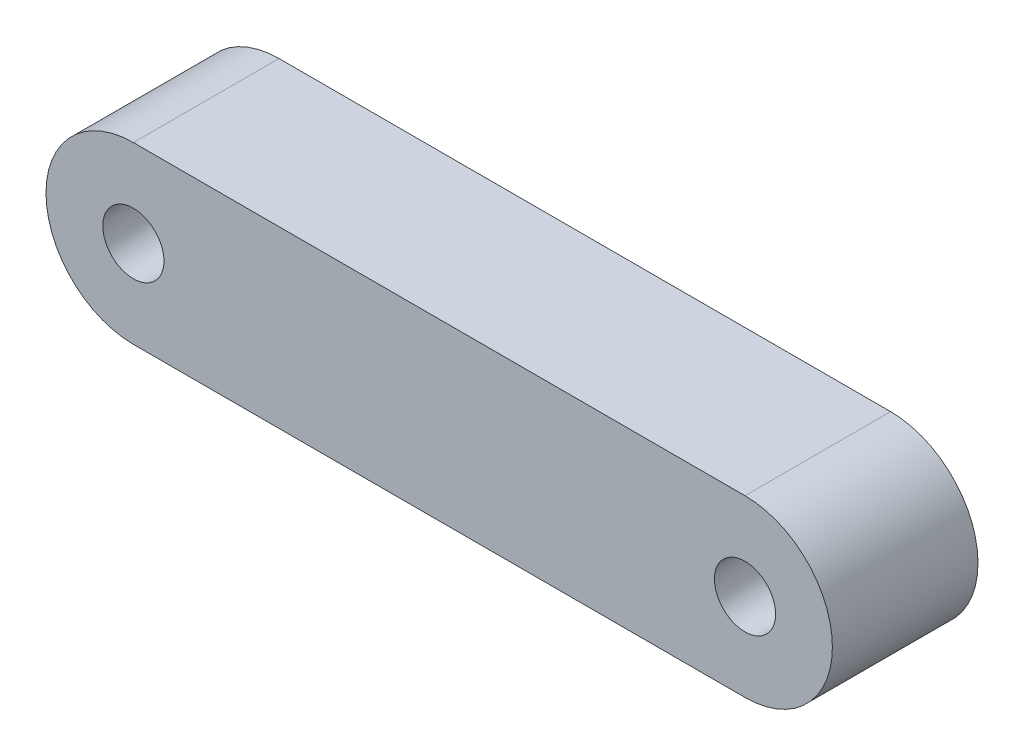
ISO-10303-21;
HEADER;
FILE_DESCRIPTION(('STEP AP214'),'2;1');
FILE_NAME('part.step','',(''),(''),'','','');
FILE_SCHEMA(('AUTOMOTIVE_DESIGN { 1 0 10303 214 1 1 1 1 }'));
ENDSEC;
DATA;
#1=APPLICATION_CONTEXT('core data for automotive mechanical design processes');
#2=APPLICATION_PROTOCOL_DEFINITION('international standard','automotive_design',2000,#1);
#3=PRODUCT_CONTEXT('',#1,'mechanical');
#4=PRODUCT('Part','Part','',(#3));
#5=PRODUCT_RELATED_PRODUCT_CATEGORY('part','',(#4));
#6=PRODUCT_DEFINITION_FORMATION('','',#4);
#7=PRODUCT_DEFINITION_CONTEXT('part definition',#1,'design');
#8=PRODUCT_DEFINITION('design','',#6,#7);
#9=PRODUCT_DEFINITION_SHAPE('','',#8);
#10=(LENGTH_UNIT() NAMED_UNIT(*) SI_UNIT(.MILLI.,.METRE.));
#11=(NAMED_UNIT(*) PLANE_ANGLE_UNIT() SI_UNIT($,.RADIAN.));
#12=(NAMED_UNIT(*) SI_UNIT($,.STERADIAN.) SOLID_ANGLE_UNIT());
#13=UNCERTAINTY_MEASURE_WITH_UNIT(LENGTH_MEASURE(1.E-05),#10,'distance_accuracy_value','');
#14=(GEOMETRIC_REPRESENTATION_CONTEXT(3) GLOBAL_UNCERTAINTY_ASSIGNED_CONTEXT((#13)) GLOBAL_UNIT_ASSIGNED_CONTEXT((#10,
#11,#12)) REPRESENTATION_CONTEXT('',''));
#15=CARTESIAN_POINT('',(0.,0.,0.));
#16=DIRECTION('',(0.,0.,1.));
#17=DIRECTION('',(1.,0.,0.));
#18=AXIS2_PLACEMENT_3D('',#15,#16,#17);
#19=CARTESIAN_POINT('',(0.,0.,8.33333333333333));
#20=DIRECTION('',(0.,0.,1.));
#21=DIRECTION('',(1.,0.,0.));
#22=AXIS2_PLACEMENT_3D('',#19,#20,#21);
#23=PLANE('',#22);
#24=CARTESIAN_POINT('',(0.,0.,8.33333333333333));
#25=DIRECTION('',(0.,0.,1.));
#26=DIRECTION('',(1.,0.,0.));
#27=AXIS2_PLACEMENT_3D('',#24,#25,#26);
#28=CIRCLE('',#27,1.75);
#29=CARTESIAN_POINT('',(1.75,0.,8.33333333333333));
#30=VERTEX_POINT('',#29);
#31=EDGE_CURVE('E112',#30,#30,#28,.T.);
#32=ORIENTED_EDGE('',*,*,#31,.F.);
#33=EDGE_LOOP('',(#32));
#34=FACE_BOUND('',#33,.T.);
#35=CARTESIAN_POINT('',(0.,0.,8.33333333333333));
#36=DIRECTION('',(0.,0.,1.));
#37=DIRECTION('',(1.,0.,0.));
#38=AXIS2_PLACEMENT_3D('',#35,#36,#37);
#39=CIRCLE('',#38,5.);
#40=CARTESIAN_POINT('',(0.,5.,8.33333333333333));
#41=VERTEX_POINT('',#40);
#42=CARTESIAN_POINT('',(0.,-5.,8.33333333333333));
#43=VERTEX_POINT('',#42);
#44=EDGE_CURVE('E92',#41,#43,#39,.T.);
#45=ORIENTED_EDGE('',*,*,#44,.T.);
#46=DIRECTION('',(1.,0.,0.));
#47=VECTOR('',#46,1.);
#48=CARTESIAN_POINT('',(35.,-5.,8.33333333333333));
#49=LINE('',#48,#47);
#50=CARTESIAN_POINT('',(35.,-5.,8.33333333333333));
#51=VERTEX_POINT('',#50);
#52=EDGE_CURVE('E87',#43,#51,#49,.T.);
#53=ORIENTED_EDGE('',*,*,#52,.T.);
#54=CARTESIAN_POINT('',(35.,0.,8.33333333333333));
#55=DIRECTION('',(0.,0.,1.));
#56=DIRECTION('',(1.,0.,0.));
#57=AXIS2_PLACEMENT_3D('',#54,#55,#56);
#58=CIRCLE('',#57,5.);
#59=CARTESIAN_POINT('',(35.,5.,8.33333333333333));
#60=VERTEX_POINT('',#59);
#61=EDGE_CURVE('E90',#51,#60,#58,.T.);
#62=ORIENTED_EDGE('',*,*,#61,.T.);
#63=DIRECTION('',(-1.,0.,0.));
#64=VECTOR('',#63,1.);
#65=CARTESIAN_POINT('',(0.,5.,8.33333333333333));
#66=LINE('',#65,#64);
#67=EDGE_CURVE('E57',#60,#41,#66,.T.);
#68=ORIENTED_EDGE('',*,*,#67,.T.);
#69=EDGE_LOOP('',(#45,#53,#62,#68));
#70=FACE_BOUND('',#69,.T.);
#71=CARTESIAN_POINT('',(35.,0.,8.33333333333333));
#72=DIRECTION('',(0.,0.,1.));
#73=DIRECTION('',(1.,0.,0.));
#74=AXIS2_PLACEMENT_3D('',#71,#72,#73);
#75=CIRCLE('',#74,1.75);
#76=CARTESIAN_POINT('',(36.75,0.,8.33333333333333));
#77=VERTEX_POINT('',#76);
#78=EDGE_CURVE('E134',#77,#77,#75,.T.);
#79=ORIENTED_EDGE('',*,*,#78,.F.);
#80=EDGE_LOOP('',(#79));
#81=FACE_BOUND('',#80,.T.);
#82=ADVANCED_FACE('F39',(#34,#70,#81),#23,.T.);
#83=CARTESIAN_POINT('',(0.,0.,0.));
#84=DIRECTION('',(0.,0.,1.));
#85=DIRECTION('',(1.,0.,0.));
#86=AXIS2_PLACEMENT_3D('',#83,#84,#85);
#87=PLANE('',#86);
#88=CARTESIAN_POINT('',(0.,0.,0.));
#89=DIRECTION('',(0.,0.,1.));
#90=DIRECTION('',(1.,0.,0.));
#91=AXIS2_PLACEMENT_3D('',#88,#89,#90);
#92=CIRCLE('',#91,5.);
#93=CARTESIAN_POINT('',(0.,5.,0.));
#94=VERTEX_POINT('',#93);
#95=CARTESIAN_POINT('',(0.,-5.,0.));
#96=VERTEX_POINT('',#95);
#97=EDGE_CURVE('E108',#94,#96,#92,.T.);
#98=ORIENTED_EDGE('',*,*,#97,.F.);
#99=DIRECTION('',(-1.,0.,0.));
#100=VECTOR('',#99,1.);
#101=CARTESIAN_POINT('',(0.,5.,0.));
#102=LINE('',#101,#100);
#103=CARTESIAN_POINT('',(35.,5.,0.));
#104=VERTEX_POINT('',#103);
#105=EDGE_CURVE('E80',#104,#94,#102,.T.);
#106=ORIENTED_EDGE('',*,*,#105,.F.);
#107=CARTESIAN_POINT('',(35.,0.,0.));
#108=DIRECTION('',(0.,0.,1.));
#109=DIRECTION('',(1.,0.,0.));
#110=AXIS2_PLACEMENT_3D('',#107,#108,#109);
#111=CIRCLE('',#110,5.);
#112=CARTESIAN_POINT('',(35.,-5.,0.));
#113=VERTEX_POINT('',#112);
#114=EDGE_CURVE('E74',#113,#104,#111,.T.);
#115=ORIENTED_EDGE('',*,*,#114,.F.);
#116=DIRECTION('',(1.,0.,0.));
#117=VECTOR('',#116,1.);
#118=CARTESIAN_POINT('',(35.,-5.,0.));
#119=LINE('',#118,#117);
#120=EDGE_CURVE('E97',#96,#113,#119,.T.);
#121=ORIENTED_EDGE('',*,*,#120,.F.);
#122=EDGE_LOOP('',(#98,#106,#115,#121));
#123=FACE_BOUND('',#122,.T.);
#124=CARTESIAN_POINT('',(0.,0.,0.));
#125=DIRECTION('',(0.,0.,1.));
#126=DIRECTION('',(1.,0.,0.));
#127=AXIS2_PLACEMENT_3D('',#124,#125,#126);
#128=CIRCLE('',#127,1.75);
#129=CARTESIAN_POINT('',(1.75,0.,0.));
#130=VERTEX_POINT('',#129);
#131=EDGE_CURVE('E130',#130,#130,#128,.T.);
#132=ORIENTED_EDGE('',*,*,#131,.T.);
#133=EDGE_LOOP('',(#132));
#134=FACE_BOUND('',#133,.T.);
#135=CARTESIAN_POINT('',(35.,0.,0.));
#136=DIRECTION('',(0.,0.,1.));
#137=DIRECTION('',(1.,0.,0.));
#138=AXIS2_PLACEMENT_3D('',#135,#136,#137);
#139=CIRCLE('',#138,1.75);
#140=CARTESIAN_POINT('',(36.75,0.,0.));
#141=VERTEX_POINT('',#140);
#142=EDGE_CURVE('E138',#141,#141,#139,.T.);
#143=ORIENTED_EDGE('',*,*,#142,.T.);
#144=EDGE_LOOP('',(#143));
#145=FACE_BOUND('',#144,.T.);
#146=ADVANCED_FACE('F125',(#123,#134,#145),#87,.F.);
#147=CARTESIAN_POINT('',(0.,0.,8.33333333333333));
#148=DIRECTION('',(0.,0.,-1.));
#149=DIRECTION('',(-1.,0.,0.));
#150=AXIS2_PLACEMENT_3D('',#147,#148,#149);
#151=CYLINDRICAL_SURFACE('',#150,5.);
#152=ORIENTED_EDGE('',*,*,#97,.T.);
#153=DIRECTION('',(0.,0.,-1.));
#154=VECTOR('',#153,1.);
#155=CARTESIAN_POINT('',(0.,-5.,8.33333333333333));
#156=LINE('',#155,#154);
#157=EDGE_CURVE('E11',#43,#96,#156,.T.);
#158=ORIENTED_EDGE('',*,*,#157,.F.);
#159=ORIENTED_EDGE('',*,*,#44,.F.);
#160=DIRECTION('',(0.,0.,-1.));
#161=VECTOR('',#160,1.);
#162=CARTESIAN_POINT('',(0.,5.,8.33333333333333));
#163=LINE('',#162,#161);
#164=EDGE_CURVE('E104',#41,#94,#163,.T.);
#165=ORIENTED_EDGE('',*,*,#164,.T.);
#166=EDGE_LOOP('',(#152,#158,#159,#165));
#167=FACE_BOUND('',#166,.T.);
#168=ADVANCED_FACE('F41',(#167),#151,.T.);
#169=CARTESIAN_POINT('',(35.,-5.,8.33333333333333));
#170=DIRECTION('',(0.,1.,0.));
#171=DIRECTION('',(0.,0.,1.));
#172=AXIS2_PLACEMENT_3D('',#169,#170,#171);
#173=PLANE('',#172);
#174=ORIENTED_EDGE('',*,*,#120,.T.);
#175=DIRECTION('',(0.,0.,-1.));
#176=VECTOR('',#175,1.);
#177=CARTESIAN_POINT('',(35.,-5.,8.33333333333333));
#178=LINE('',#177,#176);
#179=EDGE_CURVE('E49',#51,#113,#178,.T.);
#180=ORIENTED_EDGE('',*,*,#179,.F.);
#181=ORIENTED_EDGE('',*,*,#52,.F.);
#182=ORIENTED_EDGE('',*,*,#157,.T.);
#183=EDGE_LOOP('',(#174,#180,#181,#182));
#184=FACE_BOUND('',#183,.T.);
#185=ADVANCED_FACE('F96',(#184),#173,.F.);
#186=CARTESIAN_POINT('',(35.,0.,8.33333333333333));
#187=DIRECTION('',(0.,0.,-1.));
#188=DIRECTION('',(-1.,0.,0.));
#189=AXIS2_PLACEMENT_3D('',#186,#187,#188);
#190=CYLINDRICAL_SURFACE('',#189,5.);
#191=ORIENTED_EDGE('',*,*,#114,.T.);
#192=DIRECTION('',(0.,0.,-1.));
#193=VECTOR('',#192,1.);
#194=CARTESIAN_POINT('',(35.,5.,8.33333333333333));
#195=LINE('',#194,#193);
#196=EDGE_CURVE('E99',#60,#104,#195,.T.);
#197=ORIENTED_EDGE('',*,*,#196,.F.);
#198=ORIENTED_EDGE('',*,*,#61,.F.);
#199=ORIENTED_EDGE('',*,*,#179,.T.);
#200=EDGE_LOOP('',(#191,#197,#198,#199));
#201=FACE_BOUND('',#200,.T.);
#202=ADVANCED_FACE('F100',(#201),#190,.T.);
#203=CARTESIAN_POINT('',(0.,5.,8.33333333333333));
#204=DIRECTION('',(0.,-1.,0.));
#205=DIRECTION('',(0.,0.,-1.));
#206=AXIS2_PLACEMENT_3D('',#203,#204,#205);
#207=PLANE('',#206);
#208=ORIENTED_EDGE('',*,*,#105,.T.);
#209=ORIENTED_EDGE('',*,*,#164,.F.);
#210=ORIENTED_EDGE('',*,*,#67,.F.);
#211=ORIENTED_EDGE('',*,*,#196,.T.);
#212=EDGE_LOOP('',(#208,#209,#210,#211));
#213=FACE_BOUND('',#212,.T.);
#214=ADVANCED_FACE('F122',(#213),#207,.F.);
#215=CARTESIAN_POINT('',(0.,0.,8.33333333333333));
#216=DIRECTION('',(0.,0.,-1.));
#217=DIRECTION('',(-1.,0.,0.));
#218=AXIS2_PLACEMENT_3D('',#215,#216,#217);
#219=CYLINDRICAL_SURFACE('',#218,1.75);
#220=ORIENTED_EDGE('',*,*,#31,.T.);
#221=EDGE_LOOP('',(#220));
#222=FACE_BOUND('',#221,.T.);
#223=ORIENTED_EDGE('',*,*,#131,.F.);
#224=EDGE_LOOP('',(#223));
#225=FACE_BOUND('',#224,.T.);
#226=ADVANCED_FACE('F157',(#222,#225),#219,.F.);
#227=CARTESIAN_POINT('',(35.,0.,8.33333333333333));
#228=DIRECTION('',(0.,0.,-1.));
#229=DIRECTION('',(-1.,0.,0.));
#230=AXIS2_PLACEMENT_3D('',#227,#228,#229);
#231=CYLINDRICAL_SURFACE('',#230,1.75);
#232=ORIENTED_EDGE('',*,*,#78,.T.);
#233=EDGE_LOOP('',(#232));
#234=FACE_BOUND('',#233,.T.);
#235=ORIENTED_EDGE('',*,*,#142,.F.);
#236=EDGE_LOOP('',(#235));
#237=FACE_BOUND('',#236,.T.);
#238=ADVANCED_FACE('F146',(#234,#237),#231,.F.);
#239=CLOSED_SHELL('',(#82,#146,#168,#185,#202,#214,#226,#238));
#240=MANIFOLD_SOLID_BREP('B2',#239);
#241=ADVANCED_BREP_SHAPE_REPRESENTATION('',(#18,#240),#14);
#242=SHAPE_DEFINITION_REPRESENTATION(#9,#241);
ENDSEC;
END-ISO-10303-21;
